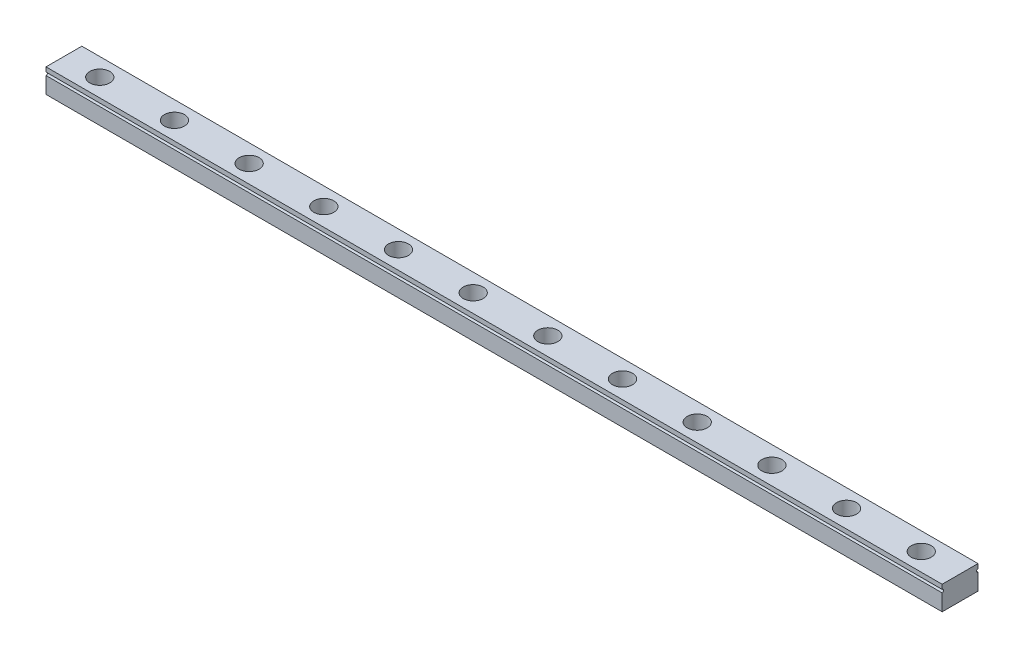
ISO-10303-21;
HEADER;
FILE_DESCRIPTION(('STEP AP214'),'2;1');
FILE_NAME('part.step','',(''),(''),'','','');
FILE_SCHEMA(('AUTOMOTIVE_DESIGN { 1 0 10303 214 1 1 1 1 }'));
ENDSEC;
DATA;
#1=APPLICATION_CONTEXT('core data for automotive mechanical design processes');
#2=APPLICATION_PROTOCOL_DEFINITION('international standard','automotive_design',2000,#1);
#3=PRODUCT_CONTEXT('',#1,'mechanical');
#4=PRODUCT('Part','Part','',(#3));
#5=PRODUCT_RELATED_PRODUCT_CATEGORY('part','',(#4));
#6=PRODUCT_DEFINITION_FORMATION('','',#4);
#7=PRODUCT_DEFINITION_CONTEXT('part definition',#1,'design');
#8=PRODUCT_DEFINITION('design','',#6,#7);
#9=PRODUCT_DEFINITION_SHAPE('','',#8);
#10=(LENGTH_UNIT() NAMED_UNIT(*) SI_UNIT(.MILLI.,.METRE.));
#11=(NAMED_UNIT(*) PLANE_ANGLE_UNIT() SI_UNIT($,.RADIAN.));
#12=(NAMED_UNIT(*) SI_UNIT($,.STERADIAN.) SOLID_ANGLE_UNIT());
#13=UNCERTAINTY_MEASURE_WITH_UNIT(LENGTH_MEASURE(1.E-05),#10,'distance_accuracy_value','');
#14=(GEOMETRIC_REPRESENTATION_CONTEXT(3) GLOBAL_UNCERTAINTY_ASSIGNED_CONTEXT((#13)) GLOBAL_UNIT_ASSIGNED_CONTEXT((#10,
#11,#12)) REPRESENTATION_CONTEXT('',''));
#15=CARTESIAN_POINT('',(0.,0.,0.));
#16=DIRECTION('',(0.,0.,1.));
#17=DIRECTION('',(1.,0.,0.));
#18=AXIS2_PLACEMENT_3D('',#15,#16,#17);
#19=CARTESIAN_POINT('',(-13.,8.,-6.));
#20=DIRECTION('',(0.,1.,0.));
#21=DIRECTION('',(0.,0.,1.));
#22=AXIS2_PLACEMENT_3D('',#19,#20,#21);
#23=CYLINDRICAL_SURFACE('',#22,3.35000000000002);
#24=CARTESIAN_POINT('',(-13.,1.85,-6.));
#25=DIRECTION('',(0.,1.,0.));
#26=DIRECTION('',(0.,0.,1.));
#27=AXIS2_PLACEMENT_3D('',#24,#25,#26);
#28=CIRCLE('',#27,3.35000000000002);
#29=CARTESIAN_POINT('',(-13.,1.85,-2.64999999999998));
#30=VERTEX_POINT('',#29);
#31=EDGE_CURVE('E11',#30,#30,#28,.T.);
#32=ORIENTED_EDGE('',*,*,#31,.F.);
#33=EDGE_LOOP('',(#32));
#34=FACE_BOUND('',#33,.T.);
#35=CARTESIAN_POINT('',(-13.,8.,-6.));
#36=DIRECTION('',(0.,1.,0.));
#37=DIRECTION('',(0.,0.,1.));
#38=AXIS2_PLACEMENT_3D('',#35,#36,#37);
#39=CIRCLE('',#38,3.35000000000002);
#40=CARTESIAN_POINT('',(-13.,8.,-2.64999999999998));
#41=VERTEX_POINT('',#40);
#42=EDGE_CURVE('E331',#41,#41,#39,.T.);
#43=ORIENTED_EDGE('',*,*,#42,.T.);
#44=EDGE_LOOP('',(#43));
#45=FACE_BOUND('',#44,.T.);
#46=ADVANCED_FACE('F45',(#34,#45),#23,.F.);
#47=CARTESIAN_POINT('',(-11.3,1.85,-6.));
#48=DIRECTION('',(0.,-1.,0.));
#49=DIRECTION('',(0.,0.,-1.));
#50=AXIS2_PLACEMENT_3D('',#47,#48,#49);
#51=PLANE('',#50);
#52=CARTESIAN_POINT('',(-13.,1.85,-6.));
#53=DIRECTION('',(0.,1.,0.));
#54=DIRECTION('',(0.,0.,1.));
#55=AXIS2_PLACEMENT_3D('',#52,#53,#54);
#56=CIRCLE('',#55,1.69999999999998);
#57=CARTESIAN_POINT('',(-13.,1.85,-4.30000000000002));
#58=VERTEX_POINT('',#57);
#59=EDGE_CURVE('E54',#58,#58,#56,.T.);
#60=ORIENTED_EDGE('',*,*,#59,.F.);
#61=EDGE_LOOP('',(#60));
#62=FACE_BOUND('',#61,.T.);
#63=ORIENTED_EDGE('',*,*,#31,.T.);
#64=EDGE_LOOP('',(#63));
#65=FACE_BOUND('',#64,.T.);
#66=ADVANCED_FACE('F344',(#62,#65),#51,.F.);
#67=CARTESIAN_POINT('',(-13.,8.,-6.));
#68=DIRECTION('',(0.,1.,0.));
#69=DIRECTION('',(0.,0.,1.));
#70=AXIS2_PLACEMENT_3D('',#67,#68,#69);
#71=CYLINDRICAL_SURFACE('',#70,1.69999999999998);
#72=CARTESIAN_POINT('',(-13.,0.,-6.));
#73=DIRECTION('',(0.,1.,0.));
#74=DIRECTION('',(0.,0.,1.));
#75=AXIS2_PLACEMENT_3D('',#72,#73,#74);
#76=CIRCLE('',#75,1.69999999999998);
#77=CARTESIAN_POINT('',(-13.,0.,-4.30000000000002));
#78=VERTEX_POINT('',#77);
#79=EDGE_CURVE('E335',#78,#78,#76,.T.);
#80=ORIENTED_EDGE('',*,*,#79,.F.);
#81=EDGE_LOOP('',(#80));
#82=FACE_BOUND('',#81,.T.);
#83=ORIENTED_EDGE('',*,*,#59,.T.);
#84=EDGE_LOOP('',(#83));
#85=FACE_BOUND('',#84,.T.);
#86=ADVANCED_FACE('F342',(#82,#85),#71,.F.);
#87=CARTESIAN_POINT('',(-38.,8.,-6.));
#88=DIRECTION('',(0.,1.,0.));
#89=DIRECTION('',(0.,0.,1.));
#90=AXIS2_PLACEMENT_3D('',#87,#88,#89);
#91=CYLINDRICAL_SURFACE('',#90,3.35000000000002);
#92=CARTESIAN_POINT('',(-38.,1.85,-6.));
#93=DIRECTION('',(0.,1.,0.));
#94=DIRECTION('',(0.,0.,1.));
#95=AXIS2_PLACEMENT_3D('',#92,#93,#94);
#96=CIRCLE('',#95,3.35000000000002);
#97=CARTESIAN_POINT('',(-38.,1.85,-2.64999999999998));
#98=VERTEX_POINT('',#97);
#99=EDGE_CURVE('E327',#98,#98,#96,.T.);
#100=ORIENTED_EDGE('',*,*,#99,.F.);
#101=EDGE_LOOP('',(#100));
#102=FACE_BOUND('',#101,.T.);
#103=CARTESIAN_POINT('',(-38.,8.,-6.));
#104=DIRECTION('',(0.,1.,0.));
#105=DIRECTION('',(0.,0.,1.));
#106=AXIS2_PLACEMENT_3D('',#103,#104,#105);
#107=CIRCLE('',#106,3.35000000000002);
#108=CARTESIAN_POINT('',(-38.,8.,-2.64999999999998));
#109=VERTEX_POINT('',#108);
#110=EDGE_CURVE('E315',#109,#109,#107,.T.);
#111=ORIENTED_EDGE('',*,*,#110,.T.);
#112=EDGE_LOOP('',(#111));
#113=FACE_BOUND('',#112,.T.);
#114=ADVANCED_FACE('F482',(#102,#113),#91,.F.);
#115=CARTESIAN_POINT('',(-36.3,1.85,-6.));
#116=DIRECTION('',(0.,-1.,0.));
#117=DIRECTION('',(0.,0.,-1.));
#118=AXIS2_PLACEMENT_3D('',#115,#116,#117);
#119=PLANE('',#118);
#120=CARTESIAN_POINT('',(-38.,1.85,-6.));
#121=DIRECTION('',(0.,1.,0.));
#122=DIRECTION('',(0.,0.,1.));
#123=AXIS2_PLACEMENT_3D('',#120,#121,#122);
#124=CIRCLE('',#123,1.69999999999998);
#125=CARTESIAN_POINT('',(-38.,1.85,-4.30000000000002));
#126=VERTEX_POINT('',#125);
#127=EDGE_CURVE('E323',#126,#126,#124,.T.);
#128=ORIENTED_EDGE('',*,*,#127,.F.);
#129=EDGE_LOOP('',(#128));
#130=FACE_BOUND('',#129,.T.);
#131=ORIENTED_EDGE('',*,*,#99,.T.);
#132=EDGE_LOOP('',(#131));
#133=FACE_BOUND('',#132,.T.);
#134=ADVANCED_FACE('F478',(#130,#133),#119,.F.);
#135=CARTESIAN_POINT('',(-38.,8.,-6.));
#136=DIRECTION('',(0.,1.,0.));
#137=DIRECTION('',(0.,0.,1.));
#138=AXIS2_PLACEMENT_3D('',#135,#136,#137);
#139=CYLINDRICAL_SURFACE('',#138,1.69999999999998);
#140=CARTESIAN_POINT('',(-38.,0.,-6.));
#141=DIRECTION('',(0.,1.,0.));
#142=DIRECTION('',(0.,0.,1.));
#143=AXIS2_PLACEMENT_3D('',#140,#141,#142);
#144=CIRCLE('',#143,1.69999999999998);
#145=CARTESIAN_POINT('',(-38.,0.,-4.30000000000002));
#146=VERTEX_POINT('',#145);
#147=EDGE_CURVE('E319',#146,#146,#144,.T.);
#148=ORIENTED_EDGE('',*,*,#147,.F.);
#149=EDGE_LOOP('',(#148));
#150=FACE_BOUND('',#149,.T.);
#151=ORIENTED_EDGE('',*,*,#127,.T.);
#152=EDGE_LOOP('',(#151));
#153=FACE_BOUND('',#152,.T.);
#154=ADVANCED_FACE('F474',(#150,#153),#139,.F.);
#155=CARTESIAN_POINT('',(-62.9999999999999,8.,-6.));
#156=DIRECTION('',(0.,1.,0.));
#157=DIRECTION('',(0.,0.,1.));
#158=AXIS2_PLACEMENT_3D('',#155,#156,#157);
#159=CYLINDRICAL_SURFACE('',#158,3.35000000000002);
#160=CARTESIAN_POINT('',(-62.9999999999999,1.85,-6.));
#161=DIRECTION('',(0.,1.,0.));
#162=DIRECTION('',(0.,0.,1.));
#163=AXIS2_PLACEMENT_3D('',#160,#161,#162);
#164=CIRCLE('',#163,3.35000000000002);
#165=CARTESIAN_POINT('',(-62.9999999999999,1.85,-2.64999999999998));
#166=VERTEX_POINT('',#165);
#167=EDGE_CURVE('E311',#166,#166,#164,.T.);
#168=ORIENTED_EDGE('',*,*,#167,.F.);
#169=EDGE_LOOP('',(#168));
#170=FACE_BOUND('',#169,.T.);
#171=CARTESIAN_POINT('',(-62.9999999999999,8.,-6.));
#172=DIRECTION('',(0.,1.,0.));
#173=DIRECTION('',(0.,0.,1.));
#174=AXIS2_PLACEMENT_3D('',#171,#172,#173);
#175=CIRCLE('',#174,3.35000000000002);
#176=CARTESIAN_POINT('',(-62.9999999999999,8.,-2.64999999999998));
#177=VERTEX_POINT('',#176);
#178=EDGE_CURVE('E299',#177,#177,#175,.T.);
#179=ORIENTED_EDGE('',*,*,#178,.T.);
#180=EDGE_LOOP('',(#179));
#181=FACE_BOUND('',#180,.T.);
#182=ADVANCED_FACE('F470',(#170,#181),#159,.F.);
#183=CARTESIAN_POINT('',(-61.3,1.85,-6.));
#184=DIRECTION('',(0.,-1.,0.));
#185=DIRECTION('',(0.,0.,-1.));
#186=AXIS2_PLACEMENT_3D('',#183,#184,#185);
#187=PLANE('',#186);
#188=CARTESIAN_POINT('',(-62.9999999999999,1.85,-6.));
#189=DIRECTION('',(0.,1.,0.));
#190=DIRECTION('',(0.,0.,1.));
#191=AXIS2_PLACEMENT_3D('',#188,#189,#190);
#192=CIRCLE('',#191,1.69999999999998);
#193=CARTESIAN_POINT('',(-62.9999999999999,1.85,-4.30000000000002));
#194=VERTEX_POINT('',#193);
#195=EDGE_CURVE('E307',#194,#194,#192,.T.);
#196=ORIENTED_EDGE('',*,*,#195,.F.);
#197=EDGE_LOOP('',(#196));
#198=FACE_BOUND('',#197,.T.);
#199=ORIENTED_EDGE('',*,*,#167,.T.);
#200=EDGE_LOOP('',(#199));
#201=FACE_BOUND('',#200,.T.);
#202=ADVANCED_FACE('F466',(#198,#201),#187,.F.);
#203=CARTESIAN_POINT('',(-62.9999999999999,8.,-6.));
#204=DIRECTION('',(0.,1.,0.));
#205=DIRECTION('',(0.,0.,1.));
#206=AXIS2_PLACEMENT_3D('',#203,#204,#205);
#207=CYLINDRICAL_SURFACE('',#206,1.69999999999998);
#208=CARTESIAN_POINT('',(-62.9999999999999,0.,-6.));
#209=DIRECTION('',(0.,1.,0.));
#210=DIRECTION('',(0.,0.,1.));
#211=AXIS2_PLACEMENT_3D('',#208,#209,#210);
#212=CIRCLE('',#211,1.69999999999998);
#213=CARTESIAN_POINT('',(-62.9999999999999,0.,-4.30000000000002));
#214=VERTEX_POINT('',#213);
#215=EDGE_CURVE('E303',#214,#214,#212,.T.);
#216=ORIENTED_EDGE('',*,*,#215,.F.);
#217=EDGE_LOOP('',(#216));
#218=FACE_BOUND('',#217,.T.);
#219=ORIENTED_EDGE('',*,*,#195,.T.);
#220=EDGE_LOOP('',(#219));
#221=FACE_BOUND('',#220,.T.);
#222=ADVANCED_FACE('F462',(#218,#221),#207,.F.);
#223=CARTESIAN_POINT('',(-87.9999999999999,8.,-6.));
#224=DIRECTION('',(0.,1.,0.));
#225=DIRECTION('',(0.,0.,1.));
#226=AXIS2_PLACEMENT_3D('',#223,#224,#225);
#227=CYLINDRICAL_SURFACE('',#226,3.35000000000002);
#228=CARTESIAN_POINT('',(-87.9999999999999,1.85,-6.));
#229=DIRECTION('',(0.,1.,0.));
#230=DIRECTION('',(0.,0.,1.));
#231=AXIS2_PLACEMENT_3D('',#228,#229,#230);
#232=CIRCLE('',#231,3.35000000000002);
#233=CARTESIAN_POINT('',(-87.9999999999999,1.85,-2.64999999999998));
#234=VERTEX_POINT('',#233);
#235=EDGE_CURVE('E295',#234,#234,#232,.T.);
#236=ORIENTED_EDGE('',*,*,#235,.F.);
#237=EDGE_LOOP('',(#236));
#238=FACE_BOUND('',#237,.T.);
#239=CARTESIAN_POINT('',(-87.9999999999999,8.,-6.));
#240=DIRECTION('',(0.,1.,0.));
#241=DIRECTION('',(0.,0.,1.));
#242=AXIS2_PLACEMENT_3D('',#239,#240,#241);
#243=CIRCLE('',#242,3.35000000000002);
#244=CARTESIAN_POINT('',(-87.9999999999999,8.,-2.64999999999998));
#245=VERTEX_POINT('',#244);
#246=EDGE_CURVE('E283',#245,#245,#243,.T.);
#247=ORIENTED_EDGE('',*,*,#246,.T.);
#248=EDGE_LOOP('',(#247));
#249=FACE_BOUND('',#248,.T.);
#250=ADVANCED_FACE('F458',(#238,#249),#227,.F.);
#251=CARTESIAN_POINT('',(-86.3,1.85,-6.));
#252=DIRECTION('',(0.,-1.,0.));
#253=DIRECTION('',(0.,0.,-1.));
#254=AXIS2_PLACEMENT_3D('',#251,#252,#253);
#255=PLANE('',#254);
#256=CARTESIAN_POINT('',(-87.9999999999999,1.85,-6.));
#257=DIRECTION('',(0.,1.,0.));
#258=DIRECTION('',(0.,0.,1.));
#259=AXIS2_PLACEMENT_3D('',#256,#257,#258);
#260=CIRCLE('',#259,1.69999999999998);
#261=CARTESIAN_POINT('',(-87.9999999999999,1.85,-4.30000000000002));
#262=VERTEX_POINT('',#261);
#263=EDGE_CURVE('E291',#262,#262,#260,.T.);
#264=ORIENTED_EDGE('',*,*,#263,.F.);
#265=EDGE_LOOP('',(#264));
#266=FACE_BOUND('',#265,.T.);
#267=ORIENTED_EDGE('',*,*,#235,.T.);
#268=EDGE_LOOP('',(#267));
#269=FACE_BOUND('',#268,.T.);
#270=ADVANCED_FACE('F454',(#266,#269),#255,.F.);
#271=CARTESIAN_POINT('',(-87.9999999999999,8.,-6.));
#272=DIRECTION('',(0.,1.,0.));
#273=DIRECTION('',(0.,0.,1.));
#274=AXIS2_PLACEMENT_3D('',#271,#272,#273);
#275=CYLINDRICAL_SURFACE('',#274,1.69999999999998);
#276=CARTESIAN_POINT('',(-87.9999999999999,0.,-6.));
#277=DIRECTION('',(0.,1.,0.));
#278=DIRECTION('',(0.,0.,1.));
#279=AXIS2_PLACEMENT_3D('',#276,#277,#278);
#280=CIRCLE('',#279,1.69999999999998);
#281=CARTESIAN_POINT('',(-87.9999999999999,0.,-4.30000000000002));
#282=VERTEX_POINT('',#281);
#283=EDGE_CURVE('E287',#282,#282,#280,.T.);
#284=ORIENTED_EDGE('',*,*,#283,.F.);
#285=EDGE_LOOP('',(#284));
#286=FACE_BOUND('',#285,.T.);
#287=ORIENTED_EDGE('',*,*,#263,.T.);
#288=EDGE_LOOP('',(#287));
#289=FACE_BOUND('',#288,.T.);
#290=ADVANCED_FACE('F450',(#286,#289),#275,.F.);
#291=CARTESIAN_POINT('',(-113.,8.,-6.));
#292=DIRECTION('',(0.,1.,0.));
#293=DIRECTION('',(0.,0.,1.));
#294=AXIS2_PLACEMENT_3D('',#291,#292,#293);
#295=CYLINDRICAL_SURFACE('',#294,3.35000000000002);
#296=CARTESIAN_POINT('',(-113.,1.85,-6.));
#297=DIRECTION('',(0.,1.,0.));
#298=DIRECTION('',(0.,0.,1.));
#299=AXIS2_PLACEMENT_3D('',#296,#297,#298);
#300=CIRCLE('',#299,3.35000000000002);
#301=CARTESIAN_POINT('',(-113.,1.85,-2.64999999999998));
#302=VERTEX_POINT('',#301);
#303=EDGE_CURVE('E279',#302,#302,#300,.T.);
#304=ORIENTED_EDGE('',*,*,#303,.F.);
#305=EDGE_LOOP('',(#304));
#306=FACE_BOUND('',#305,.T.);
#307=CARTESIAN_POINT('',(-113.,8.,-6.));
#308=DIRECTION('',(0.,1.,0.));
#309=DIRECTION('',(0.,0.,1.));
#310=AXIS2_PLACEMENT_3D('',#307,#308,#309);
#311=CIRCLE('',#310,3.35000000000002);
#312=CARTESIAN_POINT('',(-113.,8.,-2.64999999999998));
#313=VERTEX_POINT('',#312);
#314=EDGE_CURVE('E267',#313,#313,#311,.T.);
#315=ORIENTED_EDGE('',*,*,#314,.T.);
#316=EDGE_LOOP('',(#315));
#317=FACE_BOUND('',#316,.T.);
#318=ADVANCED_FACE('F446',(#306,#317),#295,.F.);
#319=CARTESIAN_POINT('',(-111.3,1.85,-6.));
#320=DIRECTION('',(0.,-1.,0.));
#321=DIRECTION('',(0.,0.,-1.));
#322=AXIS2_PLACEMENT_3D('',#319,#320,#321);
#323=PLANE('',#322);
#324=CARTESIAN_POINT('',(-113.,1.85,-6.));
#325=DIRECTION('',(0.,1.,0.));
#326=DIRECTION('',(0.,0.,1.));
#327=AXIS2_PLACEMENT_3D('',#324,#325,#326);
#328=CIRCLE('',#327,1.69999999999998);
#329=CARTESIAN_POINT('',(-113.,1.85,-4.30000000000002));
#330=VERTEX_POINT('',#329);
#331=EDGE_CURVE('E275',#330,#330,#328,.T.);
#332=ORIENTED_EDGE('',*,*,#331,.F.);
#333=EDGE_LOOP('',(#332));
#334=FACE_BOUND('',#333,.T.);
#335=ORIENTED_EDGE('',*,*,#303,.T.);
#336=EDGE_LOOP('',(#335));
#337=FACE_BOUND('',#336,.T.);
#338=ADVANCED_FACE('F442',(#334,#337),#323,.F.);
#339=CARTESIAN_POINT('',(-113.,8.,-6.));
#340=DIRECTION('',(0.,1.,0.));
#341=DIRECTION('',(0.,0.,1.));
#342=AXIS2_PLACEMENT_3D('',#339,#340,#341);
#343=CYLINDRICAL_SURFACE('',#342,1.69999999999998);
#344=CARTESIAN_POINT('',(-113.,0.,-6.));
#345=DIRECTION('',(0.,1.,0.));
#346=DIRECTION('',(0.,0.,1.));
#347=AXIS2_PLACEMENT_3D('',#344,#345,#346);
#348=CIRCLE('',#347,1.69999999999998);
#349=CARTESIAN_POINT('',(-113.,0.,-4.30000000000002));
#350=VERTEX_POINT('',#349);
#351=EDGE_CURVE('E271',#350,#350,#348,.T.);
#352=ORIENTED_EDGE('',*,*,#351,.F.);
#353=EDGE_LOOP('',(#352));
#354=FACE_BOUND('',#353,.T.);
#355=ORIENTED_EDGE('',*,*,#331,.T.);
#356=EDGE_LOOP('',(#355));
#357=FACE_BOUND('',#356,.T.);
#358=ADVANCED_FACE('F438',(#354,#357),#343,.F.);
#359=CARTESIAN_POINT('',(-138.,8.,-6.));
#360=DIRECTION('',(0.,1.,0.));
#361=DIRECTION('',(0.,0.,1.));
#362=AXIS2_PLACEMENT_3D('',#359,#360,#361);
#363=CYLINDRICAL_SURFACE('',#362,3.35000000000002);
#364=CARTESIAN_POINT('',(-138.,1.85,-6.));
#365=DIRECTION('',(0.,1.,0.));
#366=DIRECTION('',(0.,0.,1.));
#367=AXIS2_PLACEMENT_3D('',#364,#365,#366);
#368=CIRCLE('',#367,3.35000000000002);
#369=CARTESIAN_POINT('',(-138.,1.85,-2.64999999999998));
#370=VERTEX_POINT('',#369);
#371=EDGE_CURVE('E263',#370,#370,#368,.T.);
#372=ORIENTED_EDGE('',*,*,#371,.F.);
#373=EDGE_LOOP('',(#372));
#374=FACE_BOUND('',#373,.T.);
#375=CARTESIAN_POINT('',(-138.,8.,-6.));
#376=DIRECTION('',(0.,1.,0.));
#377=DIRECTION('',(0.,0.,1.));
#378=AXIS2_PLACEMENT_3D('',#375,#376,#377);
#379=CIRCLE('',#378,3.35000000000002);
#380=CARTESIAN_POINT('',(-138.,8.,-2.64999999999998));
#381=VERTEX_POINT('',#380);
#382=EDGE_CURVE('E251',#381,#381,#379,.T.);
#383=ORIENTED_EDGE('',*,*,#382,.T.);
#384=EDGE_LOOP('',(#383));
#385=FACE_BOUND('',#384,.T.);
#386=ADVANCED_FACE('F434',(#374,#385),#363,.F.);
#387=CARTESIAN_POINT('',(-136.3,1.85,-6.));
#388=DIRECTION('',(0.,-1.,0.));
#389=DIRECTION('',(0.,0.,-1.));
#390=AXIS2_PLACEMENT_3D('',#387,#388,#389);
#391=PLANE('',#390);
#392=CARTESIAN_POINT('',(-138.,1.85,-6.));
#393=DIRECTION('',(0.,1.,0.));
#394=DIRECTION('',(0.,0.,1.));
#395=AXIS2_PLACEMENT_3D('',#392,#393,#394);
#396=CIRCLE('',#395,1.69999999999998);
#397=CARTESIAN_POINT('',(-138.,1.85,-4.30000000000002));
#398=VERTEX_POINT('',#397);
#399=EDGE_CURVE('E259',#398,#398,#396,.T.);
#400=ORIENTED_EDGE('',*,*,#399,.F.);
#401=EDGE_LOOP('',(#400));
#402=FACE_BOUND('',#401,.T.);
#403=ORIENTED_EDGE('',*,*,#371,.T.);
#404=EDGE_LOOP('',(#403));
#405=FACE_BOUND('',#404,.T.);
#406=ADVANCED_FACE('F430',(#402,#405),#391,.F.);
#407=CARTESIAN_POINT('',(-138.,8.,-6.));
#408=DIRECTION('',(0.,1.,0.));
#409=DIRECTION('',(0.,0.,1.));
#410=AXIS2_PLACEMENT_3D('',#407,#408,#409);
#411=CYLINDRICAL_SURFACE('',#410,1.69999999999998);
#412=CARTESIAN_POINT('',(-138.,0.,-6.));
#413=DIRECTION('',(0.,1.,0.));
#414=DIRECTION('',(0.,0.,1.));
#415=AXIS2_PLACEMENT_3D('',#412,#413,#414);
#416=CIRCLE('',#415,1.69999999999998);
#417=CARTESIAN_POINT('',(-138.,0.,-4.30000000000002));
#418=VERTEX_POINT('',#417);
#419=EDGE_CURVE('E255',#418,#418,#416,.T.);
#420=ORIENTED_EDGE('',*,*,#419,.F.);
#421=EDGE_LOOP('',(#420));
#422=FACE_BOUND('',#421,.T.);
#423=ORIENTED_EDGE('',*,*,#399,.T.);
#424=EDGE_LOOP('',(#423));
#425=FACE_BOUND('',#424,.T.);
#426=ADVANCED_FACE('F426',(#422,#425),#411,.F.);
#427=CARTESIAN_POINT('',(-163.,8.,-6.));
#428=DIRECTION('',(0.,1.,0.));
#429=DIRECTION('',(0.,0.,1.));
#430=AXIS2_PLACEMENT_3D('',#427,#428,#429);
#431=CYLINDRICAL_SURFACE('',#430,3.35000000000002);
#432=CARTESIAN_POINT('',(-163.,1.85,-6.));
#433=DIRECTION('',(0.,1.,0.));
#434=DIRECTION('',(0.,0.,1.));
#435=AXIS2_PLACEMENT_3D('',#432,#433,#434);
#436=CIRCLE('',#435,3.35000000000002);
#437=CARTESIAN_POINT('',(-163.,1.85,-2.64999999999998));
#438=VERTEX_POINT('',#437);
#439=EDGE_CURVE('E247',#438,#438,#436,.T.);
#440=ORIENTED_EDGE('',*,*,#439,.F.);
#441=EDGE_LOOP('',(#440));
#442=FACE_BOUND('',#441,.T.);
#443=CARTESIAN_POINT('',(-163.,8.,-6.));
#444=DIRECTION('',(0.,1.,0.));
#445=DIRECTION('',(0.,0.,1.));
#446=AXIS2_PLACEMENT_3D('',#443,#444,#445);
#447=CIRCLE('',#446,3.35000000000002);
#448=CARTESIAN_POINT('',(-163.,8.,-2.64999999999998));
#449=VERTEX_POINT('',#448);
#450=EDGE_CURVE('E235',#449,#449,#447,.T.);
#451=ORIENTED_EDGE('',*,*,#450,.T.);
#452=EDGE_LOOP('',(#451));
#453=FACE_BOUND('',#452,.T.);
#454=ADVANCED_FACE('F422',(#442,#453),#431,.F.);
#455=CARTESIAN_POINT('',(-161.3,1.85,-6.));
#456=DIRECTION('',(0.,-1.,0.));
#457=DIRECTION('',(0.,0.,-1.));
#458=AXIS2_PLACEMENT_3D('',#455,#456,#457);
#459=PLANE('',#458);
#460=CARTESIAN_POINT('',(-163.,1.85,-6.));
#461=DIRECTION('',(0.,1.,0.));
#462=DIRECTION('',(0.,0.,1.));
#463=AXIS2_PLACEMENT_3D('',#460,#461,#462);
#464=CIRCLE('',#463,1.69999999999998);
#465=CARTESIAN_POINT('',(-163.,1.85,-4.30000000000002));
#466=VERTEX_POINT('',#465);
#467=EDGE_CURVE('E243',#466,#466,#464,.T.);
#468=ORIENTED_EDGE('',*,*,#467,.F.);
#469=EDGE_LOOP('',(#468));
#470=FACE_BOUND('',#469,.T.);
#471=ORIENTED_EDGE('',*,*,#439,.T.);
#472=EDGE_LOOP('',(#471));
#473=FACE_BOUND('',#472,.T.);
#474=ADVANCED_FACE('F418',(#470,#473),#459,.F.);
#475=CARTESIAN_POINT('',(-163.,8.,-6.));
#476=DIRECTION('',(0.,1.,0.));
#477=DIRECTION('',(0.,0.,1.));
#478=AXIS2_PLACEMENT_3D('',#475,#476,#477);
#479=CYLINDRICAL_SURFACE('',#478,1.69999999999998);
#480=CARTESIAN_POINT('',(-163.,0.,-6.));
#481=DIRECTION('',(0.,1.,0.));
#482=DIRECTION('',(0.,0.,1.));
#483=AXIS2_PLACEMENT_3D('',#480,#481,#482);
#484=CIRCLE('',#483,1.69999999999998);
#485=CARTESIAN_POINT('',(-163.,0.,-4.30000000000002));
#486=VERTEX_POINT('',#485);
#487=EDGE_CURVE('E239',#486,#486,#484,.T.);
#488=ORIENTED_EDGE('',*,*,#487,.F.);
#489=EDGE_LOOP('',(#488));
#490=FACE_BOUND('',#489,.T.);
#491=ORIENTED_EDGE('',*,*,#467,.T.);
#492=EDGE_LOOP('',(#491));
#493=FACE_BOUND('',#492,.T.);
#494=ADVANCED_FACE('F414',(#490,#493),#479,.F.);
#495=CARTESIAN_POINT('',(-188.,8.,-6.));
#496=DIRECTION('',(0.,1.,0.));
#497=DIRECTION('',(0.,0.,1.));
#498=AXIS2_PLACEMENT_3D('',#495,#496,#497);
#499=CYLINDRICAL_SURFACE('',#498,3.35000000000002);
#500=CARTESIAN_POINT('',(-188.,1.85,-6.));
#501=DIRECTION('',(0.,1.,0.));
#502=DIRECTION('',(0.,0.,1.));
#503=AXIS2_PLACEMENT_3D('',#500,#501,#502);
#504=CIRCLE('',#503,3.35000000000002);
#505=CARTESIAN_POINT('',(-188.,1.85,-2.64999999999998));
#506=VERTEX_POINT('',#505);
#507=EDGE_CURVE('E231',#506,#506,#504,.T.);
#508=ORIENTED_EDGE('',*,*,#507,.F.);
#509=EDGE_LOOP('',(#508));
#510=FACE_BOUND('',#509,.T.);
#511=CARTESIAN_POINT('',(-188.,8.,-6.));
#512=DIRECTION('',(0.,1.,0.));
#513=DIRECTION('',(0.,0.,1.));
#514=AXIS2_PLACEMENT_3D('',#511,#512,#513);
#515=CIRCLE('',#514,3.35000000000002);
#516=CARTESIAN_POINT('',(-188.,8.,-2.64999999999998));
#517=VERTEX_POINT('',#516);
#518=EDGE_CURVE('E219',#517,#517,#515,.T.);
#519=ORIENTED_EDGE('',*,*,#518,.T.);
#520=EDGE_LOOP('',(#519));
#521=FACE_BOUND('',#520,.T.);
#522=ADVANCED_FACE('F410',(#510,#521),#499,.F.);
#523=CARTESIAN_POINT('',(-186.3,1.85,-6.));
#524=DIRECTION('',(0.,-1.,0.));
#525=DIRECTION('',(0.,0.,-1.));
#526=AXIS2_PLACEMENT_3D('',#523,#524,#525);
#527=PLANE('',#526);
#528=CARTESIAN_POINT('',(-188.,1.85,-6.));
#529=DIRECTION('',(0.,1.,0.));
#530=DIRECTION('',(0.,0.,1.));
#531=AXIS2_PLACEMENT_3D('',#528,#529,#530);
#532=CIRCLE('',#531,1.69999999999998);
#533=CARTESIAN_POINT('',(-188.,1.85,-4.30000000000002));
#534=VERTEX_POINT('',#533);
#535=EDGE_CURVE('E227',#534,#534,#532,.T.);
#536=ORIENTED_EDGE('',*,*,#535,.F.);
#537=EDGE_LOOP('',(#536));
#538=FACE_BOUND('',#537,.T.);
#539=ORIENTED_EDGE('',*,*,#507,.T.);
#540=EDGE_LOOP('',(#539));
#541=FACE_BOUND('',#540,.T.);
#542=ADVANCED_FACE('F406',(#538,#541),#527,.F.);
#543=CARTESIAN_POINT('',(-188.,8.,-6.));
#544=DIRECTION('',(0.,1.,0.));
#545=DIRECTION('',(0.,0.,1.));
#546=AXIS2_PLACEMENT_3D('',#543,#544,#545);
#547=CYLINDRICAL_SURFACE('',#546,1.69999999999998);
#548=CARTESIAN_POINT('',(-188.,0.,-6.));
#549=DIRECTION('',(0.,1.,0.));
#550=DIRECTION('',(0.,0.,1.));
#551=AXIS2_PLACEMENT_3D('',#548,#549,#550);
#552=CIRCLE('',#551,1.69999999999998);
#553=CARTESIAN_POINT('',(-188.,0.,-4.30000000000002));
#554=VERTEX_POINT('',#553);
#555=EDGE_CURVE('E223',#554,#554,#552,.T.);
#556=ORIENTED_EDGE('',*,*,#555,.F.);
#557=EDGE_LOOP('',(#556));
#558=FACE_BOUND('',#557,.T.);
#559=ORIENTED_EDGE('',*,*,#535,.T.);
#560=EDGE_LOOP('',(#559));
#561=FACE_BOUND('',#560,.T.);
#562=ADVANCED_FACE('F402',(#558,#561),#547,.F.);
#563=CARTESIAN_POINT('',(-213.,8.,-6.));
#564=DIRECTION('',(0.,1.,0.));
#565=DIRECTION('',(0.,0.,1.));
#566=AXIS2_PLACEMENT_3D('',#563,#564,#565);
#567=CYLINDRICAL_SURFACE('',#566,3.35000000000002);
#568=CARTESIAN_POINT('',(-213.,1.85,-6.));
#569=DIRECTION('',(0.,1.,0.));
#570=DIRECTION('',(0.,0.,1.));
#571=AXIS2_PLACEMENT_3D('',#568,#569,#570);
#572=CIRCLE('',#571,3.35000000000002);
#573=CARTESIAN_POINT('',(-213.,1.85,-2.64999999999998));
#574=VERTEX_POINT('',#573);
#575=EDGE_CURVE('E215',#574,#574,#572,.T.);
#576=ORIENTED_EDGE('',*,*,#575,.F.);
#577=EDGE_LOOP('',(#576));
#578=FACE_BOUND('',#577,.T.);
#579=CARTESIAN_POINT('',(-213.,8.,-6.));
#580=DIRECTION('',(0.,1.,0.));
#581=DIRECTION('',(0.,0.,1.));
#582=AXIS2_PLACEMENT_3D('',#579,#580,#581);
#583=CIRCLE('',#582,3.35000000000002);
#584=CARTESIAN_POINT('',(-213.,8.,-2.64999999999998));
#585=VERTEX_POINT('',#584);
#586=EDGE_CURVE('E203',#585,#585,#583,.T.);
#587=ORIENTED_EDGE('',*,*,#586,.T.);
#588=EDGE_LOOP('',(#587));
#589=FACE_BOUND('',#588,.T.);
#590=ADVANCED_FACE('F398',(#578,#589),#567,.F.);
#591=CARTESIAN_POINT('',(-211.3,1.85,-6.));
#592=DIRECTION('',(0.,-1.,0.));
#593=DIRECTION('',(0.,0.,-1.));
#594=AXIS2_PLACEMENT_3D('',#591,#592,#593);
#595=PLANE('',#594);
#596=CARTESIAN_POINT('',(-213.,1.85,-6.));
#597=DIRECTION('',(0.,1.,0.));
#598=DIRECTION('',(0.,0.,1.));
#599=AXIS2_PLACEMENT_3D('',#596,#597,#598);
#600=CIRCLE('',#599,1.69999999999998);
#601=CARTESIAN_POINT('',(-213.,1.85,-4.30000000000002));
#602=VERTEX_POINT('',#601);
#603=EDGE_CURVE('E211',#602,#602,#600,.T.);
#604=ORIENTED_EDGE('',*,*,#603,.F.);
#605=EDGE_LOOP('',(#604));
#606=FACE_BOUND('',#605,.T.);
#607=ORIENTED_EDGE('',*,*,#575,.T.);
#608=EDGE_LOOP('',(#607));
#609=FACE_BOUND('',#608,.T.);
#610=ADVANCED_FACE('F394',(#606,#609),#595,.F.);
#611=CARTESIAN_POINT('',(-213.,8.,-6.));
#612=DIRECTION('',(0.,1.,0.));
#613=DIRECTION('',(0.,0.,1.));
#614=AXIS2_PLACEMENT_3D('',#611,#612,#613);
#615=CYLINDRICAL_SURFACE('',#614,1.69999999999998);
#616=CARTESIAN_POINT('',(-213.,0.,-6.));
#617=DIRECTION('',(0.,1.,0.));
#618=DIRECTION('',(0.,0.,1.));
#619=AXIS2_PLACEMENT_3D('',#616,#617,#618);
#620=CIRCLE('',#619,1.69999999999998);
#621=CARTESIAN_POINT('',(-213.,0.,-4.30000000000002));
#622=VERTEX_POINT('',#621);
#623=EDGE_CURVE('E207',#622,#622,#620,.T.);
#624=ORIENTED_EDGE('',*,*,#623,.F.);
#625=EDGE_LOOP('',(#624));
#626=FACE_BOUND('',#625,.T.);
#627=ORIENTED_EDGE('',*,*,#603,.T.);
#628=EDGE_LOOP('',(#627));
#629=FACE_BOUND('',#628,.T.);
#630=ADVANCED_FACE('F390',(#626,#629),#615,.F.);
#631=CARTESIAN_POINT('',(-238.,8.,-6.));
#632=DIRECTION('',(0.,1.,0.));
#633=DIRECTION('',(0.,0.,1.));
#634=AXIS2_PLACEMENT_3D('',#631,#632,#633);
#635=CYLINDRICAL_SURFACE('',#634,3.35000000000002);
#636=CARTESIAN_POINT('',(-238.,1.85,-6.));
#637=DIRECTION('',(0.,1.,0.));
#638=DIRECTION('',(0.,0.,1.));
#639=AXIS2_PLACEMENT_3D('',#636,#637,#638);
#640=CIRCLE('',#639,3.35000000000002);
#641=CARTESIAN_POINT('',(-238.,1.85,-2.64999999999998));
#642=VERTEX_POINT('',#641);
#643=EDGE_CURVE('E199',#642,#642,#640,.T.);
#644=ORIENTED_EDGE('',*,*,#643,.F.);
#645=EDGE_LOOP('',(#644));
#646=FACE_BOUND('',#645,.T.);
#647=CARTESIAN_POINT('',(-238.,8.,-6.));
#648=DIRECTION('',(0.,1.,0.));
#649=DIRECTION('',(0.,0.,1.));
#650=AXIS2_PLACEMENT_3D('',#647,#648,#649);
#651=CIRCLE('',#650,3.35000000000002);
#652=CARTESIAN_POINT('',(-238.,8.,-2.64999999999998));
#653=VERTEX_POINT('',#652);
#654=EDGE_CURVE('E172',#653,#653,#651,.T.);
#655=ORIENTED_EDGE('',*,*,#654,.T.);
#656=EDGE_LOOP('',(#655));
#657=FACE_BOUND('',#656,.T.);
#658=ADVANCED_FACE('F386',(#646,#657),#635,.F.);
#659=CARTESIAN_POINT('',(-236.3,1.85,-6.));
#660=DIRECTION('',(0.,-1.,0.));
#661=DIRECTION('',(0.,0.,-1.));
#662=AXIS2_PLACEMENT_3D('',#659,#660,#661);
#663=PLANE('',#662);
#664=CARTESIAN_POINT('',(-238.,1.85,-6.));
#665=DIRECTION('',(0.,1.,0.));
#666=DIRECTION('',(0.,0.,1.));
#667=AXIS2_PLACEMENT_3D('',#664,#665,#666);
#668=CIRCLE('',#667,1.69999999999998);
#669=CARTESIAN_POINT('',(-238.,1.85,-4.30000000000002));
#670=VERTEX_POINT('',#669);
#671=EDGE_CURVE('E195',#670,#670,#668,.T.);
#672=ORIENTED_EDGE('',*,*,#671,.F.);
#673=EDGE_LOOP('',(#672));
#674=FACE_BOUND('',#673,.T.);
#675=ORIENTED_EDGE('',*,*,#643,.T.);
#676=EDGE_LOOP('',(#675));
#677=FACE_BOUND('',#676,.T.);
#678=ADVANCED_FACE('F382',(#674,#677),#663,.F.);
#679=CARTESIAN_POINT('',(-238.,8.,-6.));
#680=DIRECTION('',(0.,1.,0.));
#681=DIRECTION('',(0.,0.,1.));
#682=AXIS2_PLACEMENT_3D('',#679,#680,#681);
#683=CYLINDRICAL_SURFACE('',#682,1.69999999999998);
#684=CARTESIAN_POINT('',(-238.,0.,-6.));
#685=DIRECTION('',(0.,1.,0.));
#686=DIRECTION('',(0.,0.,1.));
#687=AXIS2_PLACEMENT_3D('',#684,#685,#686);
#688=CIRCLE('',#687,1.69999999999998);
#689=CARTESIAN_POINT('',(-238.,0.,-4.30000000000002));
#690=VERTEX_POINT('',#689);
#691=EDGE_CURVE('E191',#690,#690,#688,.T.);
#692=ORIENTED_EDGE('',*,*,#691,.F.);
#693=EDGE_LOOP('',(#692));
#694=FACE_BOUND('',#693,.T.);
#695=ORIENTED_EDGE('',*,*,#671,.T.);
#696=EDGE_LOOP('',(#695));
#697=FACE_BOUND('',#696,.T.);
#698=ADVANCED_FACE('F378',(#694,#697),#683,.F.);
#699=CARTESIAN_POINT('',(-300.,0.,0.));
#700=DIRECTION('',(0.,-1.,0.));
#701=DIRECTION('',(0.,0.,-1.));
#702=AXIS2_PLACEMENT_3D('',#699,#700,#701);
#703=PLANE('',#702);
#704=CARTESIAN_POINT('',(-263.,0.,-6.));
#705=DIRECTION('',(0.,1.,0.));
#706=DIRECTION('',(0.,0.,1.));
#707=AXIS2_PLACEMENT_3D('',#704,#705,#706);
#708=CIRCLE('',#707,1.69999999999998);
#709=CARTESIAN_POINT('',(-263.,0.,-4.30000000000002));
#710=VERTEX_POINT('',#709);
#711=EDGE_CURVE('E870',#710,#710,#708,.T.);
#712=ORIENTED_EDGE('',*,*,#711,.T.);
#713=EDGE_LOOP('',(#712));
#714=FACE_BOUND('',#713,.T.);
#715=CARTESIAN_POINT('',(-288.,0.,-6.));
#716=DIRECTION('',(0.,1.,0.));
#717=DIRECTION('',(0.,0.,1.));
#718=AXIS2_PLACEMENT_3D('',#715,#716,#717);
#719=CIRCLE('',#718,1.69999999999998);
#720=CARTESIAN_POINT('',(-288.,0.,-4.30000000000002));
#721=VERTEX_POINT('',#720);
#722=EDGE_CURVE('E151',#721,#721,#719,.T.);
#723=ORIENTED_EDGE('',*,*,#722,.T.);
#724=EDGE_LOOP('',(#723));
#725=FACE_BOUND('',#724,.T.);
#726=DIRECTION('',(0.,0.,-1.));
#727=VECTOR('',#726,1.);
#728=CARTESIAN_POINT('',(0.,0.,0.));
#729=LINE('',#728,#727);
#730=CARTESIAN_POINT('',(0.,0.,0.));
#731=VERTEX_POINT('',#730);
#732=CARTESIAN_POINT('',(0.,0.,-12.));
#733=VERTEX_POINT('',#732);
#734=EDGE_CURVE('E146',#731,#733,#729,.T.);
#735=ORIENTED_EDGE('',*,*,#734,.F.);
#736=DIRECTION('',(1.,0.,0.));
#737=VECTOR('',#736,1.);
#738=CARTESIAN_POINT('',(-300.,0.,0.));
#739=LINE('',#738,#737);
#740=CARTESIAN_POINT('',(-300.,0.,0.));
#741=VERTEX_POINT('',#740);
#742=EDGE_CURVE('E62',#741,#731,#739,.T.);
#743=ORIENTED_EDGE('',*,*,#742,.F.);
#744=DIRECTION('',(0.,0.,-1.));
#745=VECTOR('',#744,1.);
#746=CARTESIAN_POINT('',(-300.,0.,0.));
#747=LINE('',#746,#745);
#748=CARTESIAN_POINT('',(-300.,0.,-12.));
#749=VERTEX_POINT('',#748);
#750=EDGE_CURVE('E897',#741,#749,#747,.T.);
#751=ORIENTED_EDGE('',*,*,#750,.T.);
#752=DIRECTION('',(1.,0.,0.));
#753=VECTOR('',#752,1.);
#754=CARTESIAN_POINT('',(-300.,0.,-12.));
#755=LINE('',#754,#753);
#756=EDGE_CURVE('E103',#749,#733,#755,.T.);
#757=ORIENTED_EDGE('',*,*,#756,.T.);
#758=EDGE_LOOP('',(#735,#743,#751,#757));
#759=FACE_BOUND('',#758,.T.);
#760=ORIENTED_EDGE('',*,*,#691,.T.);
#761=EDGE_LOOP('',(#760));
#762=FACE_BOUND('',#761,.T.);
#763=ORIENTED_EDGE('',*,*,#623,.T.);
#764=EDGE_LOOP('',(#763));
#765=FACE_BOUND('',#764,.T.);
#766=ORIENTED_EDGE('',*,*,#555,.T.);
#767=EDGE_LOOP('',(#766));
#768=FACE_BOUND('',#767,.T.);
#769=ORIENTED_EDGE('',*,*,#487,.T.);
#770=EDGE_LOOP('',(#769));
#771=FACE_BOUND('',#770,.T.);
#772=ORIENTED_EDGE('',*,*,#419,.T.);
#773=EDGE_LOOP('',(#772));
#774=FACE_BOUND('',#773,.T.);
#775=ORIENTED_EDGE('',*,*,#351,.T.);
#776=EDGE_LOOP('',(#775));
#777=FACE_BOUND('',#776,.T.);
#778=ORIENTED_EDGE('',*,*,#283,.T.);
#779=EDGE_LOOP('',(#778));
#780=FACE_BOUND('',#779,.T.);
#781=ORIENTED_EDGE('',*,*,#215,.T.);
#782=EDGE_LOOP('',(#781));
#783=FACE_BOUND('',#782,.T.);
#784=ORIENTED_EDGE('',*,*,#147,.T.);
#785=EDGE_LOOP('',(#784));
#786=FACE_BOUND('',#785,.T.);
#787=ORIENTED_EDGE('',*,*,#79,.T.);
#788=EDGE_LOOP('',(#787));
#789=FACE_BOUND('',#788,.T.);
#790=ADVANCED_FACE('F375',(#714,#725,#759,#762,#765,#768,#771,#774,#777,#780,#783,#786,#789),
#703,.T.);
#791=CARTESIAN_POINT('',(-300.,0.,0.));
#792=DIRECTION('',(0.,0.,-1.));
#793=DIRECTION('',(-1.,0.,0.));
#794=AXIS2_PLACEMENT_3D('',#791,#792,#793);
#795=PLANE('',#794);
#796=DIRECTION('',(0.,1.,0.));
#797=VECTOR('',#796,1.);
#798=CARTESIAN_POINT('',(0.,0.,0.));
#799=LINE('',#798,#797);
#800=CARTESIAN_POINT('',(0.,5.5,0.));
#801=VERTEX_POINT('',#800);
#802=EDGE_CURVE('E167',#731,#801,#799,.T.);
#803=ORIENTED_EDGE('',*,*,#802,.T.);
#804=DIRECTION('',(1.,0.,0.));
#805=VECTOR('',#804,1.);
#806=CARTESIAN_POINT('',(-300.,5.5,0.));
#807=LINE('',#806,#805);
#808=CARTESIAN_POINT('',(-300.,5.5,0.));
#809=VERTEX_POINT('',#808);
#810=EDGE_CURVE('E92',#809,#801,#807,.T.);
#811=ORIENTED_EDGE('',*,*,#810,.F.);
#812=DIRECTION('',(0.,1.,0.));
#813=VECTOR('',#812,1.);
#814=CARTESIAN_POINT('',(-300.,0.,0.));
#815=LINE('',#814,#813);
#816=EDGE_CURVE('E138',#741,#809,#815,.T.);
#817=ORIENTED_EDGE('',*,*,#816,.F.);
#818=ORIENTED_EDGE('',*,*,#742,.T.);
#819=EDGE_LOOP('',(#803,#811,#817,#818));
#820=FACE_BOUND('',#819,.T.);
#821=ADVANCED_FACE('F367',(#820),#795,.F.);
#822=CARTESIAN_POINT('',(-300.,6.,0.));
#823=DIRECTION('',(1.,0.,0.));
#824=DIRECTION('',(0.,0.,-1.));
#825=AXIS2_PLACEMENT_3D('',#822,#823,#824);
#826=CYLINDRICAL_SURFACE('',#825,0.5);
#827=CARTESIAN_POINT('',(0.,6.,0.));
#828=DIRECTION('',(1.,0.,0.));
#829=DIRECTION('',(0.,0.,-1.));
#830=AXIS2_PLACEMENT_3D('',#827,#828,#829);
#831=CIRCLE('',#830,0.5);
#832=CARTESIAN_POINT('',(0.,6.5,0.));
#833=VERTEX_POINT('',#832);
#834=EDGE_CURVE('E123',#833,#801,#831,.F.);
#835=ORIENTED_EDGE('',*,*,#834,.F.);
#836=DIRECTION('',(1.,0.,0.));
#837=VECTOR('',#836,1.);
#838=CARTESIAN_POINT('',(-300.,6.5,0.));
#839=LINE('',#838,#837);
#840=CARTESIAN_POINT('',(-300.,6.5,0.));
#841=VERTEX_POINT('',#840);
#842=EDGE_CURVE('E117',#841,#833,#839,.T.);
#843=ORIENTED_EDGE('',*,*,#842,.F.);
#844=CARTESIAN_POINT('',(-300.,6.,0.));
#845=DIRECTION('',(1.,0.,0.));
#846=DIRECTION('',(0.,0.,-1.));
#847=AXIS2_PLACEMENT_3D('',#844,#845,#846);
#848=CIRCLE('',#847,0.5);
#849=EDGE_CURVE('E121',#841,#809,#848,.F.);
#850=ORIENTED_EDGE('',*,*,#849,.T.);
#851=ORIENTED_EDGE('',*,*,#810,.T.);
#852=EDGE_LOOP('',(#835,#843,#850,#851));
#853=FACE_BOUND('',#852,.T.);
#854=ADVANCED_FACE('F119',(#853),#826,.F.);
#855=CARTESIAN_POINT('',(0.,8.,0.));
#856=VERTEX_POINT('',#855);
#857=EDGE_CURVE('E164',#833,#856,#799,.T.);
#858=ORIENTED_EDGE('',*,*,#857,.T.);
#859=DIRECTION('',(1.,0.,0.));
#860=VECTOR('',#859,1.);
#861=CARTESIAN_POINT('',(-300.,8.,0.));
#862=LINE('',#861,#860);
#863=CARTESIAN_POINT('',(-300.,8.,0.));
#864=VERTEX_POINT('',#863);
#865=EDGE_CURVE('E127',#864,#856,#862,.T.);
#866=ORIENTED_EDGE('',*,*,#865,.F.);
#867=EDGE_CURVE('E130',#841,#864,#815,.T.);
#868=ORIENTED_EDGE('',*,*,#867,.F.);
#869=ORIENTED_EDGE('',*,*,#842,.T.);
#870=EDGE_LOOP('',(#858,#866,#868,#869));
#871=FACE_BOUND('',#870,.T.);
#872=ADVANCED_FACE('F131',(#871),#795,.F.);
#873=CARTESIAN_POINT('',(-300.,8.,0.));
#874=DIRECTION('',(0.,-1.,0.));
#875=DIRECTION('',(0.,0.,-1.));
#876=AXIS2_PLACEMENT_3D('',#873,#874,#875);
#877=PLANE('',#876);
#878=CARTESIAN_POINT('',(-263.,8.,-6.));
#879=DIRECTION('',(0.,1.,0.));
#880=DIRECTION('',(0.,0.,1.));
#881=AXIS2_PLACEMENT_3D('',#878,#879,#880);
#882=CIRCLE('',#881,3.35000000000002);
#883=CARTESIAN_POINT('',(-263.,8.,-2.64999999999998));
#884=VERTEX_POINT('',#883);
#885=EDGE_CURVE('E868',#884,#884,#882,.T.);
#886=ORIENTED_EDGE('',*,*,#885,.F.);
#887=EDGE_LOOP('',(#886));
#888=FACE_BOUND('',#887,.T.);
#889=CARTESIAN_POINT('',(-288.,8.,-6.));
#890=DIRECTION('',(0.,1.,0.));
#891=DIRECTION('',(0.,0.,1.));
#892=AXIS2_PLACEMENT_3D('',#889,#890,#891);
#893=CIRCLE('',#892,3.35000000000002);
#894=CARTESIAN_POINT('',(-288.,8.,-2.64999999999998));
#895=VERTEX_POINT('',#894);
#896=EDGE_CURVE('E882',#895,#895,#893,.T.);
#897=ORIENTED_EDGE('',*,*,#896,.F.);
#898=EDGE_LOOP('',(#897));
#899=FACE_BOUND('',#898,.T.);
#900=DIRECTION('',(0.,0.,-1.));
#901=VECTOR('',#900,1.);
#902=CARTESIAN_POINT('',(0.,8.,0.));
#903=LINE('',#902,#901);
#904=CARTESIAN_POINT('',(0.,8.,-12.));
#905=VERTEX_POINT('',#904);
#906=EDGE_CURVE('E160',#856,#905,#903,.T.);
#907=ORIENTED_EDGE('',*,*,#906,.T.);
#908=DIRECTION('',(1.,0.,0.));
#909=VECTOR('',#908,1.);
#910=CARTESIAN_POINT('',(-300.,8.,-12.));
#911=LINE('',#910,#909);
#912=CARTESIAN_POINT('',(-300.,8.,-12.));
#913=VERTEX_POINT('',#912);
#914=EDGE_CURVE('E177',#913,#905,#911,.T.);
#915=ORIENTED_EDGE('',*,*,#914,.F.);
#916=DIRECTION('',(0.,0.,-1.));
#917=VECTOR('',#916,1.);
#918=CARTESIAN_POINT('',(-300.,8.,0.));
#919=LINE('',#918,#917);
#920=EDGE_CURVE('E136',#864,#913,#919,.T.);
#921=ORIENTED_EDGE('',*,*,#920,.F.);
#922=ORIENTED_EDGE('',*,*,#865,.T.);
#923=EDGE_LOOP('',(#907,#915,#921,#922));
#924=FACE_BOUND('',#923,.T.);
#925=ORIENTED_EDGE('',*,*,#654,.F.);
#926=EDGE_LOOP('',(#925));
#927=FACE_BOUND('',#926,.T.);
#928=ORIENTED_EDGE('',*,*,#586,.F.);
#929=EDGE_LOOP('',(#928));
#930=FACE_BOUND('',#929,.T.);
#931=ORIENTED_EDGE('',*,*,#518,.F.);
#932=EDGE_LOOP('',(#931));
#933=FACE_BOUND('',#932,.T.);
#934=ORIENTED_EDGE('',*,*,#450,.F.);
#935=EDGE_LOOP('',(#934));
#936=FACE_BOUND('',#935,.T.);
#937=ORIENTED_EDGE('',*,*,#382,.F.);
#938=EDGE_LOOP('',(#937));
#939=FACE_BOUND('',#938,.T.);
#940=ORIENTED_EDGE('',*,*,#314,.F.);
#941=EDGE_LOOP('',(#940));
#942=FACE_BOUND('',#941,.T.);
#943=ORIENTED_EDGE('',*,*,#246,.F.);
#944=EDGE_LOOP('',(#943));
#945=FACE_BOUND('',#944,.T.);
#946=ORIENTED_EDGE('',*,*,#178,.F.);
#947=EDGE_LOOP('',(#946));
#948=FACE_BOUND('',#947,.T.);
#949=ORIENTED_EDGE('',*,*,#110,.F.);
#950=EDGE_LOOP('',(#949));
#951=FACE_BOUND('',#950,.T.);
#952=ORIENTED_EDGE('',*,*,#42,.F.);
#953=EDGE_LOOP('',(#952));
#954=FACE_BOUND('',#953,.T.);
#955=ADVANCED_FACE('F353',(#888,#899,#924,#927,#930,#933,#936,#939,#942,#945,#948,#951,#954),
#877,.F.);
#956=CARTESIAN_POINT('',(-300.,0.,-12.));
#957=DIRECTION('',(0.,0.,-1.));
#958=DIRECTION('',(-1.,0.,0.));
#959=AXIS2_PLACEMENT_3D('',#956,#957,#958);
#960=PLANE('',#959);
#961=DIRECTION('',(0.,1.,0.));
#962=VECTOR('',#961,1.);
#963=CARTESIAN_POINT('',(0.,0.,-12.));
#964=LINE('',#963,#962);
#965=CARTESIAN_POINT('',(0.,6.5,-12.));
#966=VERTEX_POINT('',#965);
#967=EDGE_CURVE('E156',#966,#905,#964,.T.);
#968=ORIENTED_EDGE('',*,*,#967,.F.);
#969=DIRECTION('',(1.,0.,0.));
#970=VECTOR('',#969,1.);
#971=CARTESIAN_POINT('',(-300.,6.5,-12.));
#972=LINE('',#971,#970);
#973=CARTESIAN_POINT('',(-300.,6.5,-12.));
#974=VERTEX_POINT('',#973);
#975=EDGE_CURVE('E180',#974,#966,#972,.T.);
#976=ORIENTED_EDGE('',*,*,#975,.F.);
#977=DIRECTION('',(0.,1.,0.));
#978=VECTOR('',#977,1.);
#979=CARTESIAN_POINT('',(-300.,0.,-12.));
#980=LINE('',#979,#978);
#981=EDGE_CURVE('E904',#974,#913,#980,.T.);
#982=ORIENTED_EDGE('',*,*,#981,.T.);
#983=ORIENTED_EDGE('',*,*,#914,.T.);
#984=EDGE_LOOP('',(#968,#976,#982,#983));
#985=FACE_BOUND('',#984,.T.);
#986=ADVANCED_FACE('F355',(#985),#960,.T.);
#987=CARTESIAN_POINT('',(-300.,6.,-12.));
#988=DIRECTION('',(1.,0.,0.));
#989=DIRECTION('',(0.,0.,-1.));
#990=AXIS2_PLACEMENT_3D('',#987,#988,#989);
#991=CYLINDRICAL_SURFACE('',#990,0.5);
#992=CARTESIAN_POINT('',(0.,6.,-12.));
#993=DIRECTION('',(1.,0.,0.));
#994=DIRECTION('',(0.,0.,-1.));
#995=AXIS2_PLACEMENT_3D('',#992,#993,#994);
#996=CIRCLE('',#995,0.5);
#997=CARTESIAN_POINT('',(0.,5.5,-12.));
#998=VERTEX_POINT('',#997);
#999=EDGE_CURVE('E155',#966,#998,#996,.T.);
#1000=ORIENTED_EDGE('',*,*,#999,.T.);
#1001=DIRECTION('',(1.,0.,0.));
#1002=VECTOR('',#1001,1.);
#1003=CARTESIAN_POINT('',(-300.,5.5,-12.));
#1004=LINE('',#1003,#1002);
#1005=CARTESIAN_POINT('',(-300.,5.5,-12.));
#1006=VERTEX_POINT('',#1005);
#1007=EDGE_CURVE('E183',#1006,#998,#1004,.T.);
#1008=ORIENTED_EDGE('',*,*,#1007,.F.);
#1009=CARTESIAN_POINT('',(-300.,6.,-12.));
#1010=DIRECTION('',(1.,0.,0.));
#1011=DIRECTION('',(0.,0.,-1.));
#1012=AXIS2_PLACEMENT_3D('',#1009,#1010,#1011);
#1013=CIRCLE('',#1012,0.5);
#1014=EDGE_CURVE('E903',#974,#1006,#1013,.T.);
#1015=ORIENTED_EDGE('',*,*,#1014,.F.);
#1016=ORIENTED_EDGE('',*,*,#975,.T.);
#1017=EDGE_LOOP('',(#1000,#1008,#1015,#1016));
#1018=FACE_BOUND('',#1017,.T.);
#1019=ADVANCED_FACE('F362',(#1018),#991,.F.);
#1020=EDGE_CURVE('E150',#733,#998,#964,.T.);
#1021=ORIENTED_EDGE('',*,*,#1020,.F.);
#1022=ORIENTED_EDGE('',*,*,#756,.F.);
#1023=EDGE_CURVE('E900',#749,#1006,#980,.T.);
#1024=ORIENTED_EDGE('',*,*,#1023,.T.);
#1025=ORIENTED_EDGE('',*,*,#1007,.T.);
#1026=EDGE_LOOP('',(#1021,#1022,#1024,#1025));
#1027=FACE_BOUND('',#1026,.T.);
#1028=ADVANCED_FACE('F365',(#1027),#960,.T.);
#1029=CARTESIAN_POINT('',(-300.,0.,0.));
#1030=DIRECTION('',(1.,0.,0.));
#1031=DIRECTION('',(0.,0.,-1.));
#1032=AXIS2_PLACEMENT_3D('',#1029,#1030,#1031);
#1033=PLANE('',#1032);
#1034=ORIENTED_EDGE('',*,*,#750,.F.);
#1035=ORIENTED_EDGE('',*,*,#816,.T.);
#1036=ORIENTED_EDGE('',*,*,#849,.F.);
#1037=ORIENTED_EDGE('',*,*,#867,.T.);
#1038=ORIENTED_EDGE('',*,*,#920,.T.);
#1039=ORIENTED_EDGE('',*,*,#981,.F.);
#1040=ORIENTED_EDGE('',*,*,#1014,.T.);
#1041=ORIENTED_EDGE('',*,*,#1023,.F.);
#1042=EDGE_LOOP('',(#1034,#1035,#1036,#1037,#1038,#1039,#1040,#1041));
#1043=FACE_BOUND('',#1042,.T.);
#1044=ADVANCED_FACE('F140',(#1043),#1033,.F.);
#1045=CARTESIAN_POINT('',(0.,0.,0.));
#1046=DIRECTION('',(1.,0.,0.));
#1047=DIRECTION('',(0.,0.,-1.));
#1048=AXIS2_PLACEMENT_3D('',#1045,#1046,#1047);
#1049=PLANE('',#1048);
#1050=ORIENTED_EDGE('',*,*,#734,.T.);
#1051=ORIENTED_EDGE('',*,*,#1020,.T.);
#1052=ORIENTED_EDGE('',*,*,#999,.F.);
#1053=ORIENTED_EDGE('',*,*,#967,.T.);
#1054=ORIENTED_EDGE('',*,*,#906,.F.);
#1055=ORIENTED_EDGE('',*,*,#857,.F.);
#1056=ORIENTED_EDGE('',*,*,#834,.T.);
#1057=ORIENTED_EDGE('',*,*,#802,.F.);
#1058=EDGE_LOOP('',(#1050,#1051,#1052,#1053,#1054,#1055,#1056,#1057));
#1059=FACE_BOUND('',#1058,.T.);
#1060=ADVANCED_FACE('F655',(#1059),#1049,.T.);
#1061=CARTESIAN_POINT('',(-288.,8.,-6.));
#1062=DIRECTION('',(0.,1.,0.));
#1063=DIRECTION('',(0.,0.,1.));
#1064=AXIS2_PLACEMENT_3D('',#1061,#1062,#1063);
#1065=CYLINDRICAL_SURFACE('',#1064,1.69999999999998);
#1066=ORIENTED_EDGE('',*,*,#722,.F.);
#1067=EDGE_LOOP('',(#1066));
#1068=FACE_BOUND('',#1067,.T.);
#1069=CARTESIAN_POINT('',(-288.,1.85,-6.));
#1070=DIRECTION('',(0.,1.,0.));
#1071=DIRECTION('',(0.,0.,1.));
#1072=AXIS2_PLACEMENT_3D('',#1069,#1070,#1071);
#1073=CIRCLE('',#1072,1.69999999999998);
#1074=CARTESIAN_POINT('',(-288.,1.85,-4.30000000000002));
#1075=VERTEX_POINT('',#1074);
#1076=EDGE_CURVE('E890',#1075,#1075,#1073,.T.);
#1077=ORIENTED_EDGE('',*,*,#1076,.T.);
#1078=EDGE_LOOP('',(#1077));
#1079=FACE_BOUND('',#1078,.T.);
#1080=ADVANCED_FACE('F665',(#1068,#1079),#1065,.F.);
#1081=CARTESIAN_POINT('',(-286.3,1.85,-6.));
#1082=DIRECTION('',(0.,-1.,0.));
#1083=DIRECTION('',(0.,0.,-1.));
#1084=AXIS2_PLACEMENT_3D('',#1081,#1082,#1083);
#1085=PLANE('',#1084);
#1086=ORIENTED_EDGE('',*,*,#1076,.F.);
#1087=EDGE_LOOP('',(#1086));
#1088=FACE_BOUND('',#1087,.T.);
#1089=CARTESIAN_POINT('',(-288.,1.85,-6.));
#1090=DIRECTION('',(0.,1.,0.));
#1091=DIRECTION('',(0.,0.,1.));
#1092=AXIS2_PLACEMENT_3D('',#1089,#1090,#1091);
#1093=CIRCLE('',#1092,3.35000000000002);
#1094=CARTESIAN_POINT('',(-288.,1.85,-2.64999999999998));
#1095=VERTEX_POINT('',#1094);
#1096=EDGE_CURVE('E886',#1095,#1095,#1093,.T.);
#1097=ORIENTED_EDGE('',*,*,#1096,.T.);
#1098=EDGE_LOOP('',(#1097));
#1099=FACE_BOUND('',#1098,.T.);
#1100=ADVANCED_FACE('F675',(#1088,#1099),#1085,.F.);
#1101=CARTESIAN_POINT('',(-288.,8.,-6.));
#1102=DIRECTION('',(0.,1.,0.));
#1103=DIRECTION('',(0.,0.,1.));
#1104=AXIS2_PLACEMENT_3D('',#1101,#1102,#1103);
#1105=CYLINDRICAL_SURFACE('',#1104,3.35000000000002);
#1106=ORIENTED_EDGE('',*,*,#1096,.F.);
#1107=EDGE_LOOP('',(#1106));
#1108=FACE_BOUND('',#1107,.T.);
#1109=ORIENTED_EDGE('',*,*,#896,.T.);
#1110=EDGE_LOOP('',(#1109));
#1111=FACE_BOUND('',#1110,.T.);
#1112=ADVANCED_FACE('F686',(#1108,#1111),#1105,.F.);
#1113=CARTESIAN_POINT('',(-263.,8.,-6.));
#1114=DIRECTION('',(0.,1.,0.));
#1115=DIRECTION('',(0.,0.,1.));
#1116=AXIS2_PLACEMENT_3D('',#1113,#1114,#1115);
#1117=CYLINDRICAL_SURFACE('',#1116,1.69999999999998);
#1118=ORIENTED_EDGE('',*,*,#711,.F.);
#1119=EDGE_LOOP('',(#1118));
#1120=FACE_BOUND('',#1119,.T.);
#1121=CARTESIAN_POINT('',(-263.,1.85,-6.));
#1122=DIRECTION('',(0.,1.,0.));
#1123=DIRECTION('',(0.,0.,1.));
#1124=AXIS2_PLACEMENT_3D('',#1121,#1122,#1123);
#1125=CIRCLE('',#1124,1.69999999999998);
#1126=CARTESIAN_POINT('',(-263.,1.85,-4.30000000000002));
#1127=VERTEX_POINT('',#1126);
#1128=EDGE_CURVE('E878',#1127,#1127,#1125,.T.);
#1129=ORIENTED_EDGE('',*,*,#1128,.T.);
#1130=EDGE_LOOP('',(#1129));
#1131=FACE_BOUND('',#1130,.T.);
#1132=ADVANCED_FACE('F697',(#1120,#1131),#1117,.F.);
#1133=CARTESIAN_POINT('',(-261.3,1.85,-6.));
#1134=DIRECTION('',(0.,-1.,0.));
#1135=DIRECTION('',(0.,0.,-1.));
#1136=AXIS2_PLACEMENT_3D('',#1133,#1134,#1135);
#1137=PLANE('',#1136);
#1138=ORIENTED_EDGE('',*,*,#1128,.F.);
#1139=EDGE_LOOP('',(#1138));
#1140=FACE_BOUND('',#1139,.T.);
#1141=CARTESIAN_POINT('',(-263.,1.85,-6.));
#1142=DIRECTION('',(0.,1.,0.));
#1143=DIRECTION('',(0.,0.,1.));
#1144=AXIS2_PLACEMENT_3D('',#1141,#1142,#1143);
#1145=CIRCLE('',#1144,3.35000000000002);
#1146=CARTESIAN_POINT('',(-263.,1.85,-2.64999999999998));
#1147=VERTEX_POINT('',#1146);
#1148=EDGE_CURVE('E866',#1147,#1147,#1145,.T.);
#1149=ORIENTED_EDGE('',*,*,#1148,.T.);
#1150=EDGE_LOOP('',(#1149));
#1151=FACE_BOUND('',#1150,.T.);
#1152=ADVANCED_FACE('F836',(#1140,#1151),#1137,.F.);
#1153=CARTESIAN_POINT('',(-263.,8.,-6.));
#1154=DIRECTION('',(0.,1.,0.));
#1155=DIRECTION('',(0.,0.,1.));
#1156=AXIS2_PLACEMENT_3D('',#1153,#1154,#1155);
#1157=CYLINDRICAL_SURFACE('',#1156,3.35000000000002);
#1158=ORIENTED_EDGE('',*,*,#1148,.F.);
#1159=EDGE_LOOP('',(#1158));
#1160=FACE_BOUND('',#1159,.T.);
#1161=ORIENTED_EDGE('',*,*,#885,.T.);
#1162=EDGE_LOOP('',(#1161));
#1163=FACE_BOUND('',#1162,.T.);
#1164=ADVANCED_FACE('F847',(#1160,#1163),#1157,.F.);
#1165=CLOSED_SHELL('',(#46,#66,#86,#114,#134,#154,#182,#202,#222,#250,#270,#290,#318,#338,#358,
#386,#406,#426,#454,#474,#494,#522,#542,#562,#590,#610,#630,#658,#678,#698,#790,#821,#854,#872,
#955,#986,#1019,#1028,#1044,#1060,#1080,#1100,#1112,#1132,#1152,#1164));
#1166=MANIFOLD_SOLID_BREP('B2',#1165);
#1167=ADVANCED_BREP_SHAPE_REPRESENTATION('',(#18,#1166),#14);
#1168=SHAPE_DEFINITION_REPRESENTATION(#9,#1167);
ENDSEC;
END-ISO-10303-21;
